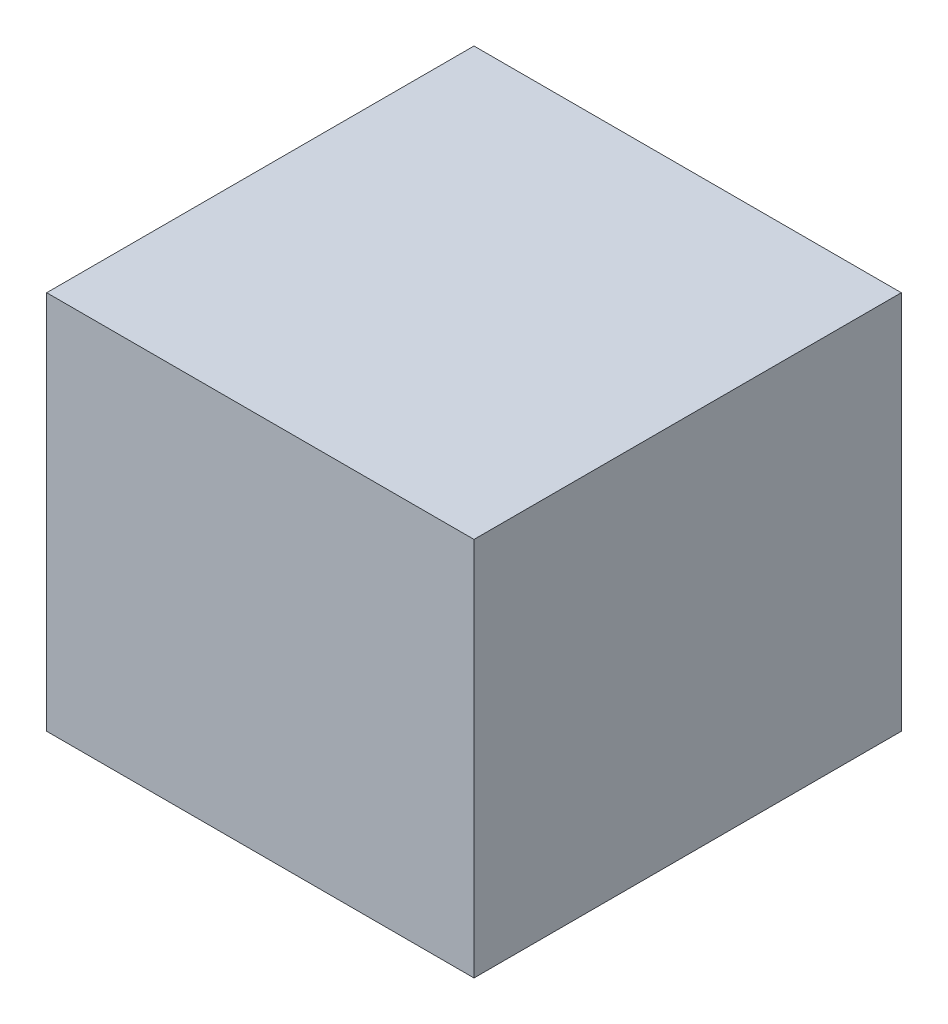
ISO-10303-21;
HEADER;
FILE_DESCRIPTION(('STEP AP214'),'2;1');
FILE_NAME('part.step','',(''),(''),'','','');
FILE_SCHEMA(('AUTOMOTIVE_DESIGN { 1 0 10303 214 1 1 1 1 }'));
ENDSEC;
DATA;
#1=APPLICATION_CONTEXT('core data for automotive mechanical design processes');
#2=APPLICATION_PROTOCOL_DEFINITION('international standard','automotive_design',2000,#1);
#3=PRODUCT_CONTEXT('',#1,'mechanical');
#4=PRODUCT('Part','Part','',(#3));
#5=PRODUCT_RELATED_PRODUCT_CATEGORY('part','',(#4));
#6=PRODUCT_DEFINITION_FORMATION('','',#4);
#7=PRODUCT_DEFINITION_CONTEXT('part definition',#1,'design');
#8=PRODUCT_DEFINITION('design','',#6,#7);
#9=PRODUCT_DEFINITION_SHAPE('','',#8);
#10=(LENGTH_UNIT() NAMED_UNIT(*) SI_UNIT(.MILLI.,.METRE.));
#11=(NAMED_UNIT(*) PLANE_ANGLE_UNIT() SI_UNIT($,.RADIAN.));
#12=(NAMED_UNIT(*) SI_UNIT($,.STERADIAN.) SOLID_ANGLE_UNIT());
#13=UNCERTAINTY_MEASURE_WITH_UNIT(LENGTH_MEASURE(1.E-05),#10,'distance_accuracy_value','');
#14=(GEOMETRIC_REPRESENTATION_CONTEXT(3) GLOBAL_UNCERTAINTY_ASSIGNED_CONTEXT((#13)) GLOBAL_UNIT_ASSIGNED_CONTEXT((#10,
#11,#12)) REPRESENTATION_CONTEXT('',''));
#15=CARTESIAN_POINT('',(0.,0.,0.));
#16=DIRECTION('',(0.,0.,1.));
#17=DIRECTION('',(1.,0.,0.));
#18=AXIS2_PLACEMENT_3D('',#15,#16,#17);
#19=CARTESIAN_POINT('',(-0.67499992,-0.5999988,0.));
#20=DIRECTION('',(0.,1.,0.));
#21=DIRECTION('',(1.,0.,0.));
#22=AXIS2_PLACEMENT_3D('',#19,#20,#21);
#23=PLANE('',#22);
#24=DIRECTION('',(1.,0.,0.));
#25=VECTOR('',#24,1.);
#26=CARTESIAN_POINT('',(-0.67499992,-0.5999988,0.));
#27=LINE('',#26,#25);
#28=CARTESIAN_POINT('',(-0.67499992,-0.5999988,0.));
#29=VERTEX_POINT('',#28);
#30=CARTESIAN_POINT('',(0.67499992,-0.5999988,0.));
#31=VERTEX_POINT('',#30);
#32=EDGE_CURVE('E11',#29,#31,#27,.T.);
#33=ORIENTED_EDGE('',*,*,#32,.T.);
#34=DIRECTION('',(0.,0.,1.));
#35=VECTOR('',#34,1.);
#36=CARTESIAN_POINT('',(0.67499992,-0.5999988,0.));
#37=LINE('',#36,#35);
#38=CARTESIAN_POINT('',(0.67499992,-0.5999988,1.34999984));
#39=VERTEX_POINT('',#38);
#40=EDGE_CURVE('E27',#31,#39,#37,.T.);
#41=ORIENTED_EDGE('',*,*,#40,.T.);
#42=DIRECTION('',(1.,0.,0.));
#43=VECTOR('',#42,1.);
#44=CARTESIAN_POINT('',(-0.67499992,-0.5999988,1.34999984));
#45=LINE('',#44,#43);
#46=CARTESIAN_POINT('',(-0.67499992,-0.5999988,1.34999984));
#47=VERTEX_POINT('',#46);
#48=EDGE_CURVE('E183',#47,#39,#45,.T.);
#49=ORIENTED_EDGE('',*,*,#48,.F.);
#50=DIRECTION('',(0.,0.,1.));
#51=VECTOR('',#50,1.);
#52=CARTESIAN_POINT('',(-0.67499992,-0.5999988,0.));
#53=LINE('',#52,#51);
#54=EDGE_CURVE('E95',#29,#47,#53,.T.);
#55=ORIENTED_EDGE('',*,*,#54,.F.);
#56=EDGE_LOOP('',(#33,#41,#49,#55));
#57=FACE_BOUND('',#56,.T.);
#58=ADVANCED_FACE('F17',(#57),#23,.F.);
#59=CARTESIAN_POINT('',(0.67499992,-0.5999988,0.));
#60=DIRECTION('',(-1.,0.,0.));
#61=DIRECTION('',(0.,0.,1.));
#62=AXIS2_PLACEMENT_3D('',#59,#60,#61);
#63=PLANE('',#62);
#64=DIRECTION('',(0.,1.,0.));
#65=VECTOR('',#64,1.);
#66=CARTESIAN_POINT('',(0.67499992,-0.5999988,0.));
#67=LINE('',#66,#65);
#68=CARTESIAN_POINT('',(0.67499992,0.60000134,0.));
#69=VERTEX_POINT('',#68);
#70=EDGE_CURVE('E174',#31,#69,#67,.T.);
#71=ORIENTED_EDGE('',*,*,#70,.T.);
#72=DIRECTION('',(0.,0.,1.));
#73=VECTOR('',#72,1.);
#74=CARTESIAN_POINT('',(0.67499992,0.60000134,0.));
#75=LINE('',#74,#73);
#76=CARTESIAN_POINT('',(0.67499992,0.60000134,1.34999984));
#77=VERTEX_POINT('',#76);
#78=EDGE_CURVE('E62',#69,#77,#75,.T.);
#79=ORIENTED_EDGE('',*,*,#78,.T.);
#80=DIRECTION('',(0.,1.,0.));
#81=VECTOR('',#80,1.);
#82=CARTESIAN_POINT('',(0.67499992,-0.5999988,1.34999984));
#83=LINE('',#82,#81);
#84=EDGE_CURVE('E68',#39,#77,#83,.T.);
#85=ORIENTED_EDGE('',*,*,#84,.F.);
#86=ORIENTED_EDGE('',*,*,#40,.F.);
#87=EDGE_LOOP('',(#71,#79,#85,#86));
#88=FACE_BOUND('',#87,.T.);
#89=ADVANCED_FACE('F121',(#88),#63,.F.);
#90=CARTESIAN_POINT('',(0.67499992,0.60000134,0.));
#91=DIRECTION('',(0.,-1.,0.));
#92=DIRECTION('',(0.,0.,-1.));
#93=AXIS2_PLACEMENT_3D('',#90,#91,#92);
#94=PLANE('',#93);
#95=DIRECTION('',(-1.,0.,0.));
#96=VECTOR('',#95,1.);
#97=CARTESIAN_POINT('',(0.67499992,0.60000134,0.));
#98=LINE('',#97,#96);
#99=CARTESIAN_POINT('',(-0.67499992,0.60000134,0.));
#100=VERTEX_POINT('',#99);
#101=EDGE_CURVE('E88',#69,#100,#98,.T.);
#102=ORIENTED_EDGE('',*,*,#101,.T.);
#103=DIRECTION('',(0.,0.,1.));
#104=VECTOR('',#103,1.);
#105=CARTESIAN_POINT('',(-0.67499992,0.60000134,0.));
#106=LINE('',#105,#104);
#107=CARTESIAN_POINT('',(-0.67499992,0.60000134,1.34999984));
#108=VERTEX_POINT('',#107);
#109=EDGE_CURVE('E76',#100,#108,#106,.T.);
#110=ORIENTED_EDGE('',*,*,#109,.T.);
#111=DIRECTION('',(-1.,0.,0.));
#112=VECTOR('',#111,1.);
#113=CARTESIAN_POINT('',(0.67499992,0.60000134,1.34999984));
#114=LINE('',#113,#112);
#115=EDGE_CURVE('E82',#77,#108,#114,.T.);
#116=ORIENTED_EDGE('',*,*,#115,.F.);
#117=ORIENTED_EDGE('',*,*,#78,.F.);
#118=EDGE_LOOP('',(#102,#110,#116,#117));
#119=FACE_BOUND('',#118,.T.);
#120=ADVANCED_FACE('F86',(#119),#94,.F.);
#121=CARTESIAN_POINT('',(-0.67499992,0.60000134,0.));
#122=DIRECTION('',(1.,0.,0.));
#123=DIRECTION('',(0.,1.,0.));
#124=AXIS2_PLACEMENT_3D('',#121,#122,#123);
#125=PLANE('',#124);
#126=DIRECTION('',(0.,-1.,0.));
#127=VECTOR('',#126,1.);
#128=CARTESIAN_POINT('',(-0.67499992,0.60000134,0.));
#129=LINE('',#128,#127);
#130=EDGE_CURVE('E91',#100,#29,#129,.T.);
#131=ORIENTED_EDGE('',*,*,#130,.T.);
#132=ORIENTED_EDGE('',*,*,#54,.T.);
#133=DIRECTION('',(0.,-1.,0.));
#134=VECTOR('',#133,1.);
#135=CARTESIAN_POINT('',(-0.67499992,0.60000134,1.34999984));
#136=LINE('',#135,#134);
#137=EDGE_CURVE('E20',#108,#47,#136,.T.);
#138=ORIENTED_EDGE('',*,*,#137,.F.);
#139=ORIENTED_EDGE('',*,*,#109,.F.);
#140=EDGE_LOOP('',(#131,#132,#138,#139));
#141=FACE_BOUND('',#140,.T.);
#142=ADVANCED_FACE('F94',(#141),#125,.F.);
#143=CARTESIAN_POINT('',(-0.67499992,-0.5999988,0.));
#144=DIRECTION('',(0.,0.,-1.));
#145=DIRECTION('',(0.,-1.,0.));
#146=AXIS2_PLACEMENT_3D('',#143,#144,#145);
#147=PLANE('',#146);
#148=ORIENTED_EDGE('',*,*,#130,.F.);
#149=ORIENTED_EDGE('',*,*,#101,.F.);
#150=ORIENTED_EDGE('',*,*,#70,.F.);
#151=ORIENTED_EDGE('',*,*,#32,.F.);
#152=EDGE_LOOP('',(#148,#149,#150,#151));
#153=FACE_BOUND('',#152,.T.);
#154=ADVANCED_FACE('F104',(#153),#147,.T.);
#155=CARTESIAN_POINT('',(-0.67499992,-0.5999988,1.34999984));
#156=DIRECTION('',(0.,0.,-1.));
#157=DIRECTION('',(0.,-1.,0.));
#158=AXIS2_PLACEMENT_3D('',#155,#156,#157);
#159=PLANE('',#158);
#160=ORIENTED_EDGE('',*,*,#48,.T.);
#161=ORIENTED_EDGE('',*,*,#84,.T.);
#162=ORIENTED_EDGE('',*,*,#115,.T.);
#163=ORIENTED_EDGE('',*,*,#137,.T.);
#164=EDGE_LOOP('',(#160,#161,#162,#163));
#165=FACE_BOUND('',#164,.T.);
#166=ADVANCED_FACE('F83',(#165),#159,.F.);
#167=CLOSED_SHELL('',(#58,#89,#120,#142,#154,#166));
#168=MANIFOLD_SOLID_BREP('B1',#167);
#169=ADVANCED_BREP_SHAPE_REPRESENTATION('',(#18,#168),#14);
#170=SHAPE_DEFINITION_REPRESENTATION(#9,#169);
ENDSEC;
END-ISO-10303-21;
